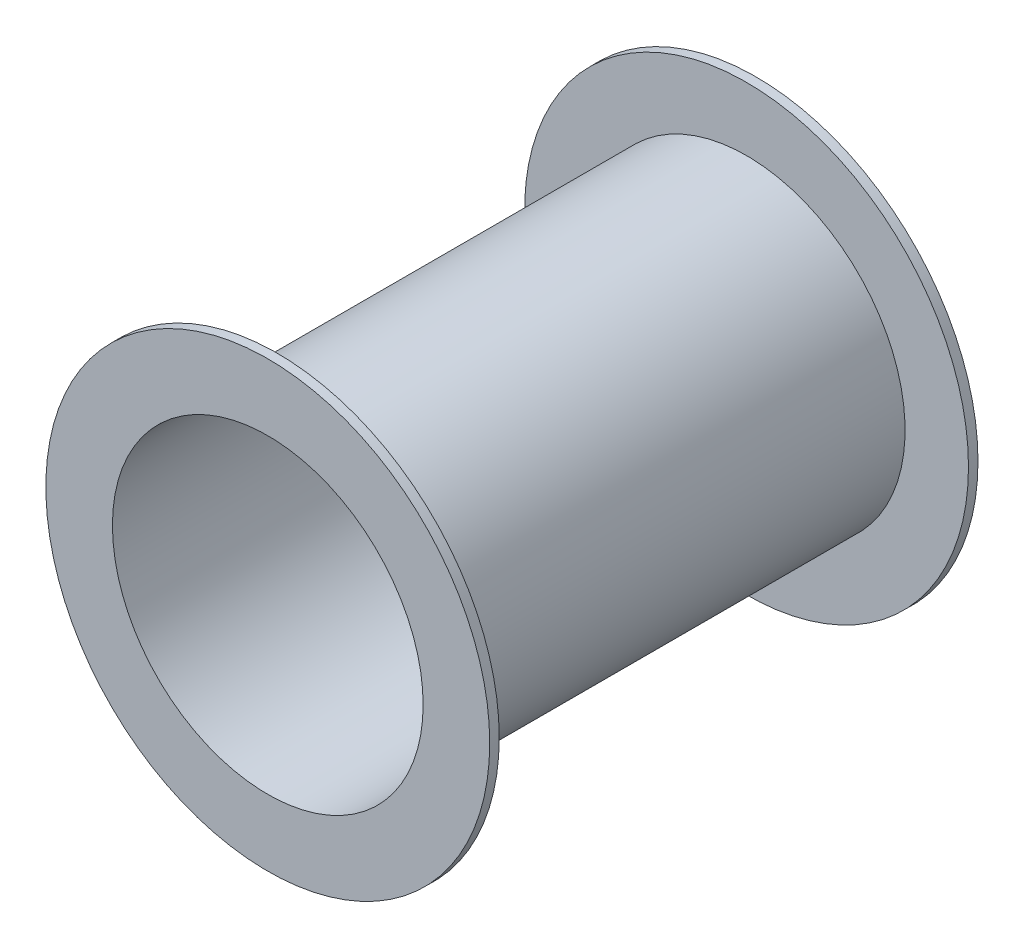
ISO-10303-21;
HEADER;
FILE_DESCRIPTION(('STEP AP214'),'2;1');
FILE_NAME('part.step','',(''),(''),'','','');
FILE_SCHEMA(('AUTOMOTIVE_DESIGN { 1 0 10303 214 1 1 1 1 }'));
ENDSEC;
DATA;
#1=APPLICATION_CONTEXT('core data for automotive mechanical design processes');
#2=APPLICATION_PROTOCOL_DEFINITION('international standard','automotive_design',2000,#1);
#3=PRODUCT_CONTEXT('',#1,'mechanical');
#4=PRODUCT('Part','Part','',(#3));
#5=PRODUCT_RELATED_PRODUCT_CATEGORY('part','',(#4));
#6=PRODUCT_DEFINITION_FORMATION('','',#4);
#7=PRODUCT_DEFINITION_CONTEXT('part definition',#1,'design');
#8=PRODUCT_DEFINITION('design','',#6,#7);
#9=PRODUCT_DEFINITION_SHAPE('','',#8);
#10=(LENGTH_UNIT() NAMED_UNIT(*) SI_UNIT(.MILLI.,.METRE.));
#11=(NAMED_UNIT(*) PLANE_ANGLE_UNIT() SI_UNIT($,.RADIAN.));
#12=(NAMED_UNIT(*) SI_UNIT($,.STERADIAN.) SOLID_ANGLE_UNIT());
#13=UNCERTAINTY_MEASURE_WITH_UNIT(LENGTH_MEASURE(1.E-05),#10,'distance_accuracy_value','');
#14=(GEOMETRIC_REPRESENTATION_CONTEXT(3) GLOBAL_UNCERTAINTY_ASSIGNED_CONTEXT((#13)) GLOBAL_UNIT_ASSIGNED_CONTEXT((#10,
#11,#12)) REPRESENTATION_CONTEXT('',''));
#15=CARTESIAN_POINT('',(0.,0.,0.));
#16=DIRECTION('',(0.,0.,1.));
#17=DIRECTION('',(1.,0.,0.));
#18=AXIS2_PLACEMENT_3D('',#15,#16,#17);
#19=CARTESIAN_POINT('',(0.,0.,308.));
#20=DIRECTION('',(0.,0.,-1.));
#21=DIRECTION('',(-1.,0.,0.));
#22=AXIS2_PLACEMENT_3D('',#19,#20,#21);
#23=CYLINDRICAL_SURFACE('',#22,100.);
#24=CARTESIAN_POINT('',(0.,0.,302.));
#25=DIRECTION('',(0.,0.,1.));
#26=DIRECTION('',(1.,0.,0.));
#27=AXIS2_PLACEMENT_3D('',#24,#25,#26);
#28=CIRCLE('',#27,100.);
#29=CARTESIAN_POINT('',(100.,0.,302.));
#30=VERTEX_POINT('',#29);
#31=EDGE_CURVE('E55',#30,#30,#28,.T.);
#32=ORIENTED_EDGE('',*,*,#31,.F.);
#33=EDGE_LOOP('',(#32));
#34=FACE_BOUND('',#33,.T.);
#35=CARTESIAN_POINT('',(0.,0.,6.00000000000001));
#36=DIRECTION('',(0.,0.,-1.));
#37=DIRECTION('',(-1.,0.,0.));
#38=AXIS2_PLACEMENT_3D('',#35,#36,#37);
#39=CIRCLE('',#38,100.);
#40=CARTESIAN_POINT('',(-100.,0.,6.00000000000001));
#41=VERTEX_POINT('',#40);
#42=EDGE_CURVE('E11',#41,#41,#39,.T.);
#43=ORIENTED_EDGE('',*,*,#42,.F.);
#44=EDGE_LOOP('',(#43));
#45=FACE_BOUND('',#44,.T.);
#46=ADVANCED_FACE('F49',(#34,#45),#23,.T.);
#47=CARTESIAN_POINT('',(0.,0.,308.));
#48=DIRECTION('',(0.,0.,1.));
#49=DIRECTION('',(1.,0.,0.));
#50=AXIS2_PLACEMENT_3D('',#47,#48,#49);
#51=PLANE('',#50);
#52=CARTESIAN_POINT('',(0.,0.,308.));
#53=DIRECTION('',(0.,0.,1.));
#54=DIRECTION('',(1.,0.,0.));
#55=AXIS2_PLACEMENT_3D('',#52,#53,#54);
#56=CIRCLE('',#55,140.);
#57=CARTESIAN_POINT('',(140.,0.,308.));
#58=VERTEX_POINT('',#57);
#59=EDGE_CURVE('E69',#58,#58,#56,.T.);
#60=ORIENTED_EDGE('',*,*,#59,.T.);
#61=EDGE_LOOP('',(#60));
#62=FACE_BOUND('',#61,.T.);
#63=CARTESIAN_POINT('',(0.,0.,308.));
#64=DIRECTION('',(0.,0.,1.));
#65=DIRECTION('',(1.,0.,0.));
#66=AXIS2_PLACEMENT_3D('',#63,#64,#65);
#67=CIRCLE('',#66,98.);
#68=CARTESIAN_POINT('',(98.,0.,308.));
#69=VERTEX_POINT('',#68);
#70=EDGE_CURVE('E59',#69,#69,#67,.T.);
#71=ORIENTED_EDGE('',*,*,#70,.F.);
#72=EDGE_LOOP('',(#71));
#73=FACE_BOUND('',#72,.T.);
#74=ADVANCED_FACE('F92',(#62,#73),#51,.T.);
#75=CARTESIAN_POINT('',(0.,0.,0.));
#76=DIRECTION('',(0.,0.,1.));
#77=DIRECTION('',(1.,0.,0.));
#78=AXIS2_PLACEMENT_3D('',#75,#76,#77);
#79=PLANE('',#78);
#80=CARTESIAN_POINT('',(0.,0.,0.));
#81=DIRECTION('',(0.,0.,1.));
#82=DIRECTION('',(1.,0.,0.));
#83=AXIS2_PLACEMENT_3D('',#80,#81,#82);
#84=CIRCLE('',#83,98.);
#85=CARTESIAN_POINT('',(98.,0.,0.));
#86=VERTEX_POINT('',#85);
#87=EDGE_CURVE('E63',#86,#86,#84,.T.);
#88=ORIENTED_EDGE('',*,*,#87,.T.);
#89=EDGE_LOOP('',(#88));
#90=FACE_BOUND('',#89,.T.);
#91=CARTESIAN_POINT('',(0.,0.,0.));
#92=DIRECTION('',(0.,0.,1.));
#93=DIRECTION('',(1.,0.,0.));
#94=AXIS2_PLACEMENT_3D('',#91,#92,#93);
#95=CIRCLE('',#94,140.);
#96=CARTESIAN_POINT('',(140.,0.,0.));
#97=VERTEX_POINT('',#96);
#98=EDGE_CURVE('E75',#97,#97,#95,.T.);
#99=ORIENTED_EDGE('',*,*,#98,.F.);
#100=EDGE_LOOP('',(#99));
#101=FACE_BOUND('',#100,.T.);
#102=ADVANCED_FACE('F89',(#90,#101),#79,.F.);
#103=CARTESIAN_POINT('',(0.,0.,308.));
#104=DIRECTION('',(0.,0.,-1.));
#105=DIRECTION('',(-1.,0.,0.));
#106=AXIS2_PLACEMENT_3D('',#103,#104,#105);
#107=CYLINDRICAL_SURFACE('',#106,98.);
#108=ORIENTED_EDGE('',*,*,#70,.T.);
#109=EDGE_LOOP('',(#108));
#110=FACE_BOUND('',#109,.T.);
#111=ORIENTED_EDGE('',*,*,#87,.F.);
#112=EDGE_LOOP('',(#111));
#113=FACE_BOUND('',#112,.T.);
#114=ADVANCED_FACE('F91',(#110,#113),#107,.F.);
#115=CARTESIAN_POINT('',(0.,0.,302.));
#116=DIRECTION('',(0.,0.,1.));
#117=DIRECTION('',(1.,0.,0.));
#118=AXIS2_PLACEMENT_3D('',#115,#116,#117);
#119=CYLINDRICAL_SURFACE('',#118,140.);
#120=CARTESIAN_POINT('',(0.,0.,302.));
#121=DIRECTION('',(0.,0.,1.));
#122=DIRECTION('',(1.,0.,0.));
#123=AXIS2_PLACEMENT_3D('',#120,#121,#122);
#124=CIRCLE('',#123,140.);
#125=CARTESIAN_POINT('',(140.,0.,302.));
#126=VERTEX_POINT('',#125);
#127=EDGE_CURVE('E67',#126,#126,#124,.T.);
#128=ORIENTED_EDGE('',*,*,#127,.T.);
#129=EDGE_LOOP('',(#128));
#130=FACE_BOUND('',#129,.T.);
#131=ORIENTED_EDGE('',*,*,#59,.F.);
#132=EDGE_LOOP('',(#131));
#133=FACE_BOUND('',#132,.T.);
#134=ADVANCED_FACE('F98',(#130,#133),#119,.T.);
#135=CARTESIAN_POINT('',(0.,0.,302.));
#136=DIRECTION('',(0.,0.,1.));
#137=DIRECTION('',(1.,0.,0.));
#138=AXIS2_PLACEMENT_3D('',#135,#136,#137);
#139=PLANE('',#138);
#140=ORIENTED_EDGE('',*,*,#31,.T.);
#141=EDGE_LOOP('',(#140));
#142=FACE_BOUND('',#141,.T.);
#143=ORIENTED_EDGE('',*,*,#127,.F.);
#144=EDGE_LOOP('',(#143));
#145=FACE_BOUND('',#144,.T.);
#146=ADVANCED_FACE('F130',(#142,#145),#139,.F.);
#147=CARTESIAN_POINT('',(0.,0.,6.));
#148=DIRECTION('',(0.,0.,-1.));
#149=DIRECTION('',(1.,0.,0.));
#150=AXIS2_PLACEMENT_3D('',#147,#148,#149);
#151=PLANE('',#150);
#152=CARTESIAN_POINT('',(0.,0.,6.));
#153=DIRECTION('',(0.,0.,1.));
#154=DIRECTION('',(1.,0.,0.));
#155=AXIS2_PLACEMENT_3D('',#152,#153,#154);
#156=CIRCLE('',#155,140.);
#157=CARTESIAN_POINT('',(140.,0.,6.));
#158=VERTEX_POINT('',#157);
#159=EDGE_CURVE('E72',#158,#158,#156,.T.);
#160=ORIENTED_EDGE('',*,*,#159,.T.);
#161=EDGE_LOOP('',(#160));
#162=FACE_BOUND('',#161,.T.);
#163=ORIENTED_EDGE('',*,*,#42,.T.);
#164=EDGE_LOOP('',(#163));
#165=FACE_BOUND('',#164,.T.);
#166=ADVANCED_FACE('F81',(#162,#165),#151,.F.);
#167=CARTESIAN_POINT('',(0.,0.,6.));
#168=DIRECTION('',(0.,0.,-1.));
#169=DIRECTION('',(-1.,0.,0.));
#170=AXIS2_PLACEMENT_3D('',#167,#168,#169);
#171=CYLINDRICAL_SURFACE('',#170,140.);
#172=ORIENTED_EDGE('',*,*,#159,.F.);
#173=EDGE_LOOP('',(#172));
#174=FACE_BOUND('',#173,.T.);
#175=ORIENTED_EDGE('',*,*,#98,.T.);
#176=EDGE_LOOP('',(#175));
#177=FACE_BOUND('',#176,.T.);
#178=ADVANCED_FACE('F83',(#174,#177),#171,.T.);
#179=CLOSED_SHELL('',(#46,#74,#102,#114,#134,#146,#166,#178));
#180=MANIFOLD_SOLID_BREP('B2',#179);
#181=ADVANCED_BREP_SHAPE_REPRESENTATION('',(#18,#180),#14);
#182=SHAPE_DEFINITION_REPRESENTATION(#9,#181);
ENDSEC;
END-ISO-10303-21;
